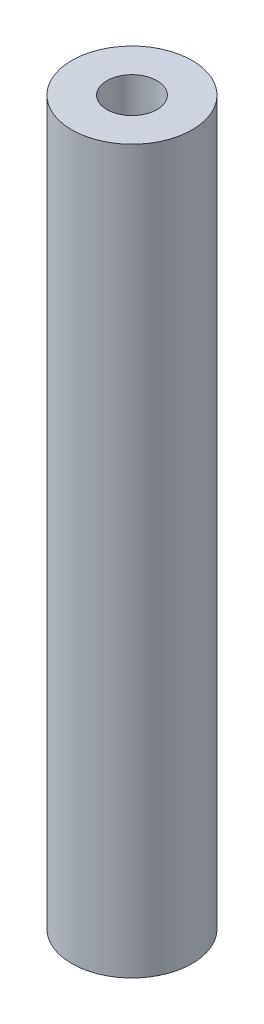
ISO-10303-21;
HEADER;
FILE_DESCRIPTION(('STEP AP214'),'2;1');
FILE_NAME('part.step','',(''),(''),'','','');
FILE_SCHEMA(('AUTOMOTIVE_DESIGN { 1 0 10303 214 1 1 1 1 }'));
ENDSEC;
DATA;
#1=APPLICATION_CONTEXT('core data for automotive mechanical design processes');
#2=APPLICATION_PROTOCOL_DEFINITION('international standard','automotive_design',2000,#1);
#3=PRODUCT_CONTEXT('',#1,'mechanical');
#4=PRODUCT('Part','Part','',(#3));
#5=PRODUCT_RELATED_PRODUCT_CATEGORY('part','',(#4));
#6=PRODUCT_DEFINITION_FORMATION('','',#4);
#7=PRODUCT_DEFINITION_CONTEXT('part definition',#1,'design');
#8=PRODUCT_DEFINITION('design','',#6,#7);
#9=PRODUCT_DEFINITION_SHAPE('','',#8);
#10=(LENGTH_UNIT() NAMED_UNIT(*) SI_UNIT(.MILLI.,.METRE.));
#11=(NAMED_UNIT(*) PLANE_ANGLE_UNIT() SI_UNIT($,.RADIAN.));
#12=(NAMED_UNIT(*) SI_UNIT($,.STERADIAN.) SOLID_ANGLE_UNIT());
#13=UNCERTAINTY_MEASURE_WITH_UNIT(LENGTH_MEASURE(1.E-05),#10,'distance_accuracy_value','');
#14=(GEOMETRIC_REPRESENTATION_CONTEXT(3) GLOBAL_UNCERTAINTY_ASSIGNED_CONTEXT((#13)) GLOBAL_UNIT_ASSIGNED_CONTEXT((#10,
#11,#12)) REPRESENTATION_CONTEXT('',''));
#15=CARTESIAN_POINT('',(0.,0.,0.));
#16=DIRECTION('',(0.,0.,1.));
#17=DIRECTION('',(1.,0.,0.));
#18=AXIS2_PLACEMENT_3D('',#15,#16,#17);
#19=CARTESIAN_POINT('',(0.,36.,0.));
#20=DIRECTION('',(0.,-1.,0.));
#21=DIRECTION('',(0.,0.,-1.));
#22=AXIS2_PLACEMENT_3D('',#19,#20,#21);
#23=CYLINDRICAL_SURFACE('',#22,3.);
#24=CARTESIAN_POINT('',(0.,36.,0.));
#25=DIRECTION('',(0.,1.,0.));
#26=DIRECTION('',(0.,0.,1.));
#27=AXIS2_PLACEMENT_3D('',#24,#25,#26);
#28=CIRCLE('',#27,3.);
#29=CARTESIAN_POINT('',(0.,36.,3.));
#30=VERTEX_POINT('',#29);
#31=EDGE_CURVE('E11',#30,#30,#28,.T.);
#32=ORIENTED_EDGE('',*,*,#31,.F.);
#33=EDGE_LOOP('',(#32));
#34=FACE_BOUND('',#33,.T.);
#35=CARTESIAN_POINT('',(0.,0.,0.));
#36=DIRECTION('',(0.,1.,0.));
#37=DIRECTION('',(0.,0.,1.));
#38=AXIS2_PLACEMENT_3D('',#35,#36,#37);
#39=CIRCLE('',#38,3.);
#40=CARTESIAN_POINT('',(0.,0.,3.));
#41=VERTEX_POINT('',#40);
#42=EDGE_CURVE('E36',#41,#41,#39,.T.);
#43=ORIENTED_EDGE('',*,*,#42,.T.);
#44=EDGE_LOOP('',(#43));
#45=FACE_BOUND('',#44,.T.);
#46=ADVANCED_FACE('F33',(#34,#45),#23,.T.);
#47=CARTESIAN_POINT('',(0.,36.,0.));
#48=DIRECTION('',(0.,1.,0.));
#49=DIRECTION('',(0.,0.,1.));
#50=AXIS2_PLACEMENT_3D('',#47,#48,#49);
#51=PLANE('',#50);
#52=CARTESIAN_POINT('',(0.,36.,0.));
#53=DIRECTION('',(0.,1.,0.));
#54=DIRECTION('',(0.,0.,1.));
#55=AXIS2_PLACEMENT_3D('',#52,#53,#54);
#56=CIRCLE('',#55,1.24999999999999);
#57=CARTESIAN_POINT('',(0.,36.,1.24999999999999));
#58=VERTEX_POINT('',#57);
#59=EDGE_CURVE('E56',#58,#58,#56,.T.);
#60=ORIENTED_EDGE('',*,*,#59,.F.);
#61=EDGE_LOOP('',(#60));
#62=FACE_BOUND('',#61,.T.);
#63=ORIENTED_EDGE('',*,*,#31,.T.);
#64=EDGE_LOOP('',(#63));
#65=FACE_BOUND('',#64,.T.);
#66=ADVANCED_FACE('F75',(#62,#65),#51,.T.);
#67=CARTESIAN_POINT('',(0.,0.,0.));
#68=DIRECTION('',(0.,1.,0.));
#69=DIRECTION('',(0.,0.,1.));
#70=AXIS2_PLACEMENT_3D('',#67,#68,#69);
#71=PLANE('',#70);
#72=CARTESIAN_POINT('',(0.,0.,0.));
#73=DIRECTION('',(0.,-1.,0.));
#74=DIRECTION('',(0.,0.,-1.));
#75=AXIS2_PLACEMENT_3D('',#72,#73,#74);
#76=CIRCLE('',#75,1.24999999999999);
#77=CARTESIAN_POINT('',(0.,0.,-1.24999999999999));
#78=VERTEX_POINT('',#77);
#79=EDGE_CURVE('E57',#78,#78,#76,.T.);
#80=ORIENTED_EDGE('',*,*,#79,.F.);
#81=EDGE_LOOP('',(#80));
#82=FACE_BOUND('',#81,.T.);
#83=ORIENTED_EDGE('',*,*,#42,.F.);
#84=EDGE_LOOP('',(#83));
#85=FACE_BOUND('',#84,.T.);
#86=ADVANCED_FACE('F72',(#82,#85),#71,.F.);
#87=CARTESIAN_POINT('',(0.,26.,0.));
#88=DIRECTION('',(0.,1.,0.));
#89=DIRECTION('',(0.,0.,1.));
#90=AXIS2_PLACEMENT_3D('',#87,#88,#89);
#91=CONICAL_SURFACE('',#90,1.25,1.02974425867665);
#92=CARTESIAN_POINT('',(0.,25.2489242262155,0.));
#93=VERTEX_POINT('',#92);
#94=VERTEX_LOOP('',#93);
#95=FACE_BOUND('',#94,.T.);
#96=CARTESIAN_POINT('',(0.,26.,0.));
#97=DIRECTION('',(0.,1.,0.));
#98=DIRECTION('',(0.,0.,1.));
#99=AXIS2_PLACEMENT_3D('',#96,#97,#98);
#100=CIRCLE('',#99,1.25);
#101=CARTESIAN_POINT('',(0.,26.,1.25));
#102=VERTEX_POINT('',#101);
#103=EDGE_CURVE('E60',#102,#102,#100,.T.);
#104=ORIENTED_EDGE('',*,*,#103,.T.);
#105=EDGE_LOOP('',(#104));
#106=FACE_BOUND('',#105,.T.);
#107=ADVANCED_FACE('F74',(#95,#106),#91,.F.);
#108=CARTESIAN_POINT('',(0.,36.,0.));
#109=DIRECTION('',(0.,1.,0.));
#110=DIRECTION('',(0.,0.,1.));
#111=AXIS2_PLACEMENT_3D('',#108,#109,#110);
#112=CYLINDRICAL_SURFACE('',#111,1.24999999999999);
#113=ORIENTED_EDGE('',*,*,#103,.F.);
#114=EDGE_LOOP('',(#113));
#115=FACE_BOUND('',#114,.T.);
#116=ORIENTED_EDGE('',*,*,#59,.T.);
#117=EDGE_LOOP('',(#116));
#118=FACE_BOUND('',#117,.T.);
#119=ADVANCED_FACE('F50',(#115,#118),#112,.F.);
#120=CARTESIAN_POINT('',(0.,9.99999999999999,0.));
#121=DIRECTION('',(0.,-1.,0.));
#122=DIRECTION('',(0.,0.,-1.));
#123=AXIS2_PLACEMENT_3D('',#120,#121,#122);
#124=CONICAL_SURFACE('',#123,1.24999999999999,1.02974425867665);
#125=CARTESIAN_POINT('',(0.,10.7510757737845,0.));
#126=VERTEX_POINT('',#125);
#127=VERTEX_LOOP('',#126);
#128=FACE_BOUND('',#127,.T.);
#129=CARTESIAN_POINT('',(0.,9.99999999999999,0.));
#130=DIRECTION('',(0.,-1.,0.));
#131=DIRECTION('',(0.,0.,-1.));
#132=AXIS2_PLACEMENT_3D('',#129,#130,#131);
#133=CIRCLE('',#132,1.24999999999999);
#134=CARTESIAN_POINT('',(0.,9.99999999999999,-1.24999999999999));
#135=VERTEX_POINT('',#134);
#136=EDGE_CURVE('E54',#135,#135,#133,.T.);
#137=ORIENTED_EDGE('',*,*,#136,.T.);
#138=EDGE_LOOP('',(#137));
#139=FACE_BOUND('',#138,.T.);
#140=ADVANCED_FACE('F46',(#128,#139),#124,.F.);
#141=CARTESIAN_POINT('',(0.,0.,0.));
#142=DIRECTION('',(0.,-1.,0.));
#143=DIRECTION('',(0.,0.,-1.));
#144=AXIS2_PLACEMENT_3D('',#141,#142,#143);
#145=CYLINDRICAL_SURFACE('',#144,1.24999999999999);
#146=ORIENTED_EDGE('',*,*,#136,.F.);
#147=EDGE_LOOP('',(#146));
#148=FACE_BOUND('',#147,.T.);
#149=ORIENTED_EDGE('',*,*,#79,.T.);
#150=EDGE_LOOP('',(#149));
#151=FACE_BOUND('',#150,.T.);
#152=ADVANCED_FACE('F49',(#148,#151),#145,.F.);
#153=CLOSED_SHELL('',(#46,#66,#86,#107,#119,#140,#152));
#154=MANIFOLD_SOLID_BREP('B2',#153);
#155=ADVANCED_BREP_SHAPE_REPRESENTATION('',(#18,#154),#14);
#156=SHAPE_DEFINITION_REPRESENTATION(#9,#155);
ENDSEC;
END-ISO-10303-21;
